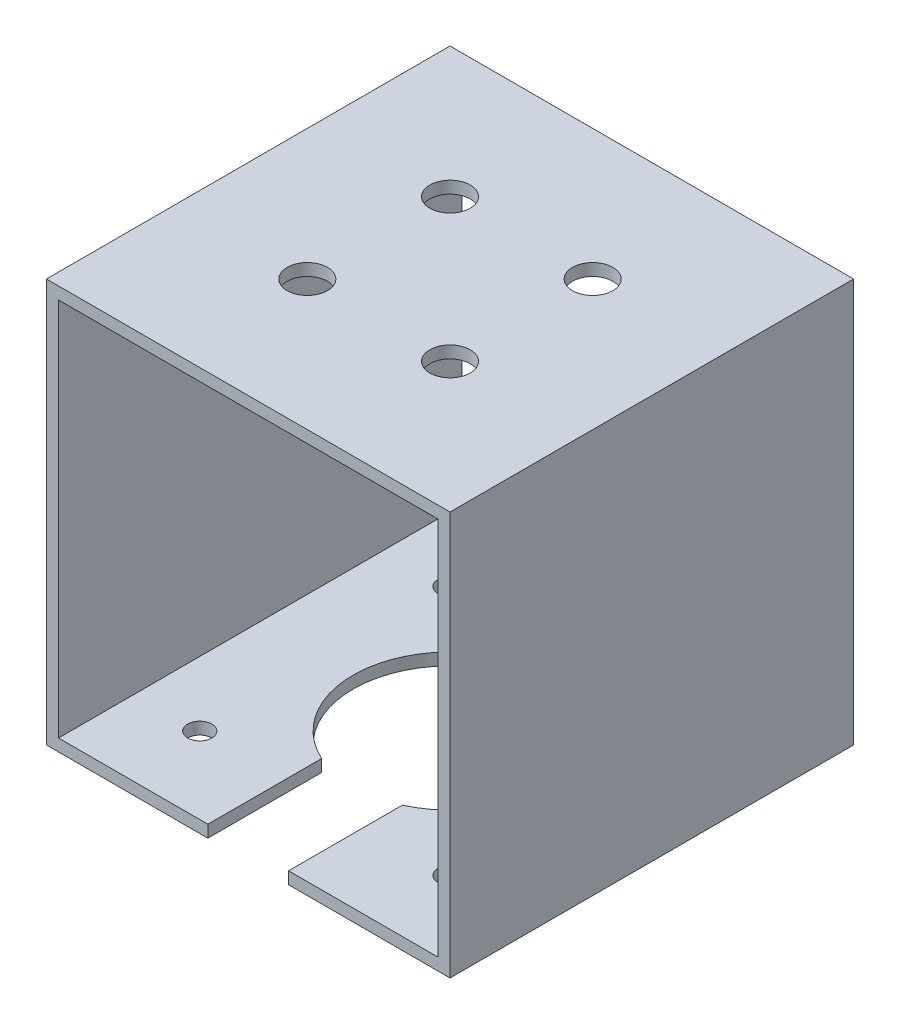
ISO-10303-21;
HEADER;
FILE_DESCRIPTION(('STEP AP214'),'2;1');
FILE_NAME('part.step','',(''),(''),'','','');
FILE_SCHEMA(('AUTOMOTIVE_DESIGN { 1 0 10303 214 1 1 1 1 }'));
ENDSEC;
DATA;
#1=APPLICATION_CONTEXT('core data for automotive mechanical design processes');
#2=APPLICATION_PROTOCOL_DEFINITION('international standard','automotive_design',2000,#1);
#3=PRODUCT_CONTEXT('',#1,'mechanical');
#4=PRODUCT('Part','Part','',(#3));
#5=PRODUCT_RELATED_PRODUCT_CATEGORY('part','',(#4));
#6=PRODUCT_DEFINITION_FORMATION('','',#4);
#7=PRODUCT_DEFINITION_CONTEXT('part definition',#1,'design');
#8=PRODUCT_DEFINITION('design','',#6,#7);
#9=PRODUCT_DEFINITION_SHAPE('','',#8);
#10=(LENGTH_UNIT() NAMED_UNIT(*) SI_UNIT(.MILLI.,.METRE.));
#11=(NAMED_UNIT(*) PLANE_ANGLE_UNIT() SI_UNIT($,.RADIAN.));
#12=(NAMED_UNIT(*) SI_UNIT($,.STERADIAN.) SOLID_ANGLE_UNIT());
#13=UNCERTAINTY_MEASURE_WITH_UNIT(LENGTH_MEASURE(1.E-05),#10,'distance_accuracy_value','');
#14=(GEOMETRIC_REPRESENTATION_CONTEXT(3) GLOBAL_UNCERTAINTY_ASSIGNED_CONTEXT((#13)) GLOBAL_UNIT_ASSIGNED_CONTEXT((#10,
#11,#12)) REPRESENTATION_CONTEXT('',''));
#15=CARTESIAN_POINT('',(0.,0.,0.));
#16=DIRECTION('',(0.,0.,1.));
#17=DIRECTION('',(1.,0.,0.));
#18=AXIS2_PLACEMENT_3D('',#15,#16,#17);
#19=CARTESIAN_POINT('',(25.,25.,50.));
#20=DIRECTION('',(0.,-1.,0.));
#21=DIRECTION('',(1.,0.,0.));
#22=AXIS2_PLACEMENT_3D('',#19,#20,#21);
#23=PLANE('',#22);
#24=CARTESIAN_POINT('',(-8.83883476483184,25.,33.8388347648319));
#25=DIRECTION('',(0.,1.,0.));
#26=DIRECTION('',(-1.,0.,0.));
#27=AXIS2_PLACEMENT_3D('',#24,#25,#26);
#28=CIRCLE('',#27,2.5);
#29=CARTESIAN_POINT('',(-11.3388347648318,25.,33.8388347648319));
#30=VERTEX_POINT('',#29);
#31=EDGE_CURVE('E160',#30,#30,#28,.T.);
#32=ORIENTED_EDGE('',*,*,#31,.F.);
#33=EDGE_LOOP('',(#32));
#34=FACE_BOUND('',#33,.T.);
#35=CARTESIAN_POINT('',(8.83883476483182,25.,33.8388347648319));
#36=DIRECTION('',(0.,1.,0.));
#37=DIRECTION('',(-1.,0.,0.));
#38=AXIS2_PLACEMENT_3D('',#35,#36,#37);
#39=CIRCLE('',#38,2.5);
#40=CARTESIAN_POINT('',(6.33883476483182,25.,33.8388347648319));
#41=VERTEX_POINT('',#40);
#42=EDGE_CURVE('E156',#41,#41,#39,.F.);
#43=ORIENTED_EDGE('',*,*,#42,.T.);
#44=EDGE_LOOP('',(#43));
#45=FACE_BOUND('',#44,.T.);
#46=CARTESIAN_POINT('',(-8.83883476483184,25.,16.1611652351681));
#47=DIRECTION('',(0.,1.,0.));
#48=DIRECTION('',(-1.,0.,0.));
#49=AXIS2_PLACEMENT_3D('',#46,#47,#48);
#50=CIRCLE('',#49,2.5);
#51=CARTESIAN_POINT('',(-11.3388347648318,25.,16.1611652351681));
#52=VERTEX_POINT('',#51);
#53=EDGE_CURVE('E169',#52,#52,#50,.F.);
#54=ORIENTED_EDGE('',*,*,#53,.T.);
#55=EDGE_LOOP('',(#54));
#56=FACE_BOUND('',#55,.T.);
#57=DIRECTION('',(-1.,0.,0.));
#58=VECTOR('',#57,1.);
#59=CARTESIAN_POINT('',(25.,25.,0.));
#60=LINE('',#59,#58);
#61=CARTESIAN_POINT('',(25.,25.,0.));
#62=VERTEX_POINT('',#61);
#63=CARTESIAN_POINT('',(-25.,25.,0.));
#64=VERTEX_POINT('',#63);
#65=EDGE_CURVE('E224',#62,#64,#60,.T.);
#66=ORIENTED_EDGE('',*,*,#65,.T.);
#67=DIRECTION('',(0.,0.,-1.));
#68=VECTOR('',#67,1.);
#69=CARTESIAN_POINT('',(-25.,25.,50.));
#70=LINE('',#69,#68);
#71=CARTESIAN_POINT('',(-25.,25.,50.));
#72=VERTEX_POINT('',#71);
#73=EDGE_CURVE('E230',#72,#64,#70,.T.);
#74=ORIENTED_EDGE('',*,*,#73,.F.);
#75=DIRECTION('',(-1.,0.,0.));
#76=VECTOR('',#75,1.);
#77=CARTESIAN_POINT('',(25.,25.,50.));
#78=LINE('',#77,#76);
#79=CARTESIAN_POINT('',(25.,25.,50.));
#80=VERTEX_POINT('',#79);
#81=EDGE_CURVE('E215',#80,#72,#78,.T.);
#82=ORIENTED_EDGE('',*,*,#81,.F.);
#83=DIRECTION('',(0.,0.,-1.));
#84=VECTOR('',#83,1.);
#85=CARTESIAN_POINT('',(25.,25.,50.));
#86=LINE('',#85,#84);
#87=EDGE_CURVE('E233',#80,#62,#86,.T.);
#88=ORIENTED_EDGE('',*,*,#87,.T.);
#89=EDGE_LOOP('',(#66,#74,#82,#88));
#90=FACE_BOUND('',#89,.T.);
#91=CARTESIAN_POINT('',(8.83883476483182,25.,16.1611652351681));
#92=DIRECTION('',(0.,1.,0.));
#93=DIRECTION('',(-1.,0.,0.));
#94=AXIS2_PLACEMENT_3D('',#91,#92,#93);
#95=CIRCLE('',#94,2.5);
#96=CARTESIAN_POINT('',(6.33883476483182,25.,16.1611652351681));
#97=VERTEX_POINT('',#96);
#98=EDGE_CURVE('E166',#97,#97,#95,.T.);
#99=ORIENTED_EDGE('',*,*,#98,.F.);
#100=EDGE_LOOP('',(#99));
#101=FACE_BOUND('',#100,.T.);
#102=ADVANCED_FACE('F55',(#34,#45,#56,#90,#101),#23,.F.);
#103=CARTESIAN_POINT('',(23.5,23.5,50.));
#104=DIRECTION('',(0.,-1.,0.));
#105=DIRECTION('',(1.,0.,0.));
#106=AXIS2_PLACEMENT_3D('',#103,#104,#105);
#107=PLANE('',#106);
#108=CARTESIAN_POINT('',(8.83883476483182,23.5,33.8388347648319));
#109=DIRECTION('',(0.,-1.,0.));
#110=DIRECTION('',(1.,0.,0.));
#111=AXIS2_PLACEMENT_3D('',#108,#109,#110);
#112=CIRCLE('',#111,2.5);
#113=CARTESIAN_POINT('',(11.3388347648318,23.5,33.8388347648319));
#114=VERTEX_POINT('',#113);
#115=EDGE_CURVE('E241',#114,#114,#112,.F.);
#116=ORIENTED_EDGE('',*,*,#115,.T.);
#117=EDGE_LOOP('',(#116));
#118=FACE_BOUND('',#117,.T.);
#119=CARTESIAN_POINT('',(-8.83883476483184,23.5,16.1611652351681));
#120=DIRECTION('',(0.,-1.,0.));
#121=DIRECTION('',(1.,0.,0.));
#122=AXIS2_PLACEMENT_3D('',#119,#120,#121);
#123=CIRCLE('',#122,2.5);
#124=CARTESIAN_POINT('',(-6.33883476483184,23.5,16.1611652351681));
#125=VERTEX_POINT('',#124);
#126=EDGE_CURVE('E174',#125,#125,#123,.F.);
#127=ORIENTED_EDGE('',*,*,#126,.T.);
#128=EDGE_LOOP('',(#127));
#129=FACE_BOUND('',#128,.T.);
#130=DIRECTION('',(-1.,0.,0.));
#131=VECTOR('',#130,1.);
#132=CARTESIAN_POINT('',(23.5,23.5,0.));
#133=LINE('',#132,#131);
#134=CARTESIAN_POINT('',(23.5,23.5,0.));
#135=VERTEX_POINT('',#134);
#136=CARTESIAN_POINT('',(-23.5,23.5,0.));
#137=VERTEX_POINT('',#136);
#138=EDGE_CURVE('E178',#135,#137,#133,.T.);
#139=ORIENTED_EDGE('',*,*,#138,.F.);
#140=DIRECTION('',(0.,0.,-1.));
#141=VECTOR('',#140,1.);
#142=CARTESIAN_POINT('',(23.5,23.5,50.));
#143=LINE('',#142,#141);
#144=CARTESIAN_POINT('',(23.5,23.5,50.));
#145=VERTEX_POINT('',#144);
#146=EDGE_CURVE('E202',#145,#135,#143,.T.);
#147=ORIENTED_EDGE('',*,*,#146,.F.);
#148=DIRECTION('',(-1.,0.,0.));
#149=VECTOR('',#148,1.);
#150=CARTESIAN_POINT('',(23.5,23.5,50.));
#151=LINE('',#150,#149);
#152=CARTESIAN_POINT('',(-23.5,23.5,50.));
#153=VERTEX_POINT('',#152);
#154=EDGE_CURVE('E185',#145,#153,#151,.T.);
#155=ORIENTED_EDGE('',*,*,#154,.T.);
#156=DIRECTION('',(0.,0.,-1.));
#157=VECTOR('',#156,1.);
#158=CARTESIAN_POINT('',(-23.5,23.5,50.));
#159=LINE('',#158,#157);
#160=EDGE_CURVE('E187',#153,#137,#159,.T.);
#161=ORIENTED_EDGE('',*,*,#160,.T.);
#162=EDGE_LOOP('',(#139,#147,#155,#161));
#163=FACE_BOUND('',#162,.T.);
#164=CARTESIAN_POINT('',(-8.83883476483184,23.5,33.8388347648319));
#165=DIRECTION('',(0.,-1.,0.));
#166=DIRECTION('',(1.,0.,0.));
#167=AXIS2_PLACEMENT_3D('',#164,#165,#166);
#168=CIRCLE('',#167,2.5);
#169=CARTESIAN_POINT('',(-6.33883476483184,23.5,33.8388347648319));
#170=VERTEX_POINT('',#169);
#171=EDGE_CURVE('E244',#170,#170,#168,.T.);
#172=ORIENTED_EDGE('',*,*,#171,.F.);
#173=EDGE_LOOP('',(#172));
#174=FACE_BOUND('',#173,.T.);
#175=CARTESIAN_POINT('',(8.83883476483182,23.5,16.1611652351681));
#176=DIRECTION('',(0.,-1.,0.));
#177=DIRECTION('',(1.,0.,0.));
#178=AXIS2_PLACEMENT_3D('',#175,#176,#177);
#179=CIRCLE('',#178,2.5);
#180=CARTESIAN_POINT('',(11.3388347648318,23.5,16.1611652351681));
#181=VERTEX_POINT('',#180);
#182=EDGE_CURVE('E192',#181,#181,#179,.T.);
#183=ORIENTED_EDGE('',*,*,#182,.F.);
#184=EDGE_LOOP('',(#183));
#185=FACE_BOUND('',#184,.T.);
#186=ADVANCED_FACE('F320',(#118,#129,#163,#174,#185),#107,.T.);
#187=CARTESIAN_POINT('',(0.,0.,50.));
#188=DIRECTION('',(0.,0.,-1.));
#189=DIRECTION('',(-1.,0.,0.));
#190=AXIS2_PLACEMENT_3D('',#187,#188,#189);
#191=PLANE('',#190);
#192=DIRECTION('',(1.,0.,0.));
#193=VECTOR('',#192,1.);
#194=CARTESIAN_POINT('',(23.5,-23.5,50.));
#195=LINE('',#194,#193);
#196=CARTESIAN_POINT('',(5.,-23.5,50.));
#197=VERTEX_POINT('',#196);
#198=CARTESIAN_POINT('',(23.5,-23.5,50.));
#199=VERTEX_POINT('',#198);
#200=EDGE_CURVE('E177',#197,#199,#195,.T.);
#201=ORIENTED_EDGE('',*,*,#200,.F.);
#202=DIRECTION('',(0.,-1.,0.));
#203=VECTOR('',#202,1.);
#204=CARTESIAN_POINT('',(5.,0.,50.));
#205=LINE('',#204,#203);
#206=CARTESIAN_POINT('',(5.,-25.,50.));
#207=VERTEX_POINT('',#206);
#208=EDGE_CURVE('E296',#197,#207,#205,.T.);
#209=ORIENTED_EDGE('',*,*,#208,.T.);
#210=DIRECTION('',(1.,0.,0.));
#211=VECTOR('',#210,1.);
#212=CARTESIAN_POINT('',(25.,-25.,50.));
#213=LINE('',#212,#211);
#214=CARTESIAN_POINT('',(25.,-25.,50.));
#215=VERTEX_POINT('',#214);
#216=EDGE_CURVE('E153',#207,#215,#213,.T.);
#217=ORIENTED_EDGE('',*,*,#216,.T.);
#218=DIRECTION('',(0.,1.,0.));
#219=VECTOR('',#218,1.);
#220=CARTESIAN_POINT('',(25.,-25.,50.));
#221=LINE('',#220,#219);
#222=EDGE_CURVE('E213',#215,#80,#221,.T.);
#223=ORIENTED_EDGE('',*,*,#222,.T.);
#224=ORIENTED_EDGE('',*,*,#81,.T.);
#225=DIRECTION('',(0.,-1.,0.));
#226=VECTOR('',#225,1.);
#227=CARTESIAN_POINT('',(-25.,-25.,50.));
#228=LINE('',#227,#226);
#229=CARTESIAN_POINT('',(-25.,-25.,50.));
#230=VERTEX_POINT('',#229);
#231=EDGE_CURVE('E217',#72,#230,#228,.T.);
#232=ORIENTED_EDGE('',*,*,#231,.T.);
#233=CARTESIAN_POINT('',(-5.,-25.,50.));
#234=VERTEX_POINT('',#233);
#235=EDGE_CURVE('E210',#230,#234,#213,.T.);
#236=ORIENTED_EDGE('',*,*,#235,.T.);
#237=DIRECTION('',(0.,1.,0.));
#238=VECTOR('',#237,1.);
#239=CARTESIAN_POINT('',(-5.,0.,50.));
#240=LINE('',#239,#238);
#241=CARTESIAN_POINT('',(-5.,-23.5,50.));
#242=VERTEX_POINT('',#241);
#243=EDGE_CURVE('E299',#234,#242,#240,.T.);
#244=ORIENTED_EDGE('',*,*,#243,.T.);
#245=CARTESIAN_POINT('',(-23.5,-23.5,50.));
#246=VERTEX_POINT('',#245);
#247=EDGE_CURVE('E179',#246,#242,#195,.T.);
#248=ORIENTED_EDGE('',*,*,#247,.F.);
#249=DIRECTION('',(0.,-1.,0.));
#250=VECTOR('',#249,1.);
#251=CARTESIAN_POINT('',(-23.5,-23.5,50.));
#252=LINE('',#251,#250);
#253=EDGE_CURVE('E175',#153,#246,#252,.T.);
#254=ORIENTED_EDGE('',*,*,#253,.F.);
#255=ORIENTED_EDGE('',*,*,#154,.F.);
#256=DIRECTION('',(0.,1.,0.));
#257=VECTOR('',#256,1.);
#258=CARTESIAN_POINT('',(23.5,-23.5,50.));
#259=LINE('',#258,#257);
#260=EDGE_CURVE('E182',#199,#145,#259,.T.);
#261=ORIENTED_EDGE('',*,*,#260,.F.);
#262=EDGE_LOOP('',(#201,#209,#217,#223,#224,#232,#236,#244,#248,#254,#255,#261));
#263=FACE_BOUND('',#262,.T.);
#264=ADVANCED_FACE('F309',(#263),#191,.F.);
#265=CARTESIAN_POINT('',(0.,0.,0.));
#266=DIRECTION('',(0.,0.,-1.));
#267=DIRECTION('',(-1.,0.,0.));
#268=AXIS2_PLACEMENT_3D('',#265,#266,#267);
#269=PLANE('',#268);
#270=DIRECTION('',(1.,0.,0.));
#271=VECTOR('',#270,1.);
#272=CARTESIAN_POINT('',(25.,-25.,0.));
#273=LINE('',#272,#271);
#274=CARTESIAN_POINT('',(-25.,-25.,0.));
#275=VERTEX_POINT('',#274);
#276=CARTESIAN_POINT('',(25.,-25.,0.));
#277=VERTEX_POINT('',#276);
#278=EDGE_CURVE('E209',#275,#277,#273,.T.);
#279=ORIENTED_EDGE('',*,*,#278,.F.);
#280=DIRECTION('',(0.,-1.,0.));
#281=VECTOR('',#280,1.);
#282=CARTESIAN_POINT('',(-25.,-25.,0.));
#283=LINE('',#282,#281);
#284=EDGE_CURVE('E226',#64,#275,#283,.T.);
#285=ORIENTED_EDGE('',*,*,#284,.F.);
#286=ORIENTED_EDGE('',*,*,#65,.F.);
#287=DIRECTION('',(0.,1.,0.));
#288=VECTOR('',#287,1.);
#289=CARTESIAN_POINT('',(25.,-25.,0.));
#290=LINE('',#289,#288);
#291=EDGE_CURVE('E222',#277,#62,#290,.T.);
#292=ORIENTED_EDGE('',*,*,#291,.F.);
#293=EDGE_LOOP('',(#279,#285,#286,#292));
#294=FACE_BOUND('',#293,.T.);
#295=ORIENTED_EDGE('',*,*,#138,.T.);
#296=DIRECTION('',(0.,-1.,0.));
#297=VECTOR('',#296,1.);
#298=CARTESIAN_POINT('',(-23.5,-23.5,0.));
#299=LINE('',#298,#297);
#300=CARTESIAN_POINT('',(-23.5,-23.5,0.));
#301=VERTEX_POINT('',#300);
#302=EDGE_CURVE('E188',#137,#301,#299,.T.);
#303=ORIENTED_EDGE('',*,*,#302,.T.);
#304=DIRECTION('',(1.,0.,0.));
#305=VECTOR('',#304,1.);
#306=CARTESIAN_POINT('',(23.5,-23.5,0.));
#307=LINE('',#306,#305);
#308=CARTESIAN_POINT('',(23.5,-23.5,0.));
#309=VERTEX_POINT('',#308);
#310=EDGE_CURVE('E191',#301,#309,#307,.T.);
#311=ORIENTED_EDGE('',*,*,#310,.T.);
#312=DIRECTION('',(0.,1.,0.));
#313=VECTOR('',#312,1.);
#314=CARTESIAN_POINT('',(23.5,-23.5,0.));
#315=LINE('',#314,#313);
#316=EDGE_CURVE('E195',#309,#135,#315,.T.);
#317=ORIENTED_EDGE('',*,*,#316,.T.);
#318=EDGE_LOOP('',(#295,#303,#311,#317));
#319=FACE_BOUND('',#318,.T.);
#320=ADVANCED_FACE('F316',(#294,#319),#269,.T.);
#321=CARTESIAN_POINT('',(25.,-25.,50.));
#322=DIRECTION('',(0.,1.,0.));
#323=DIRECTION('',(-1.,0.,0.));
#324=AXIS2_PLACEMENT_3D('',#321,#322,#323);
#325=PLANE('',#324);
#326=CARTESIAN_POINT('',(15.5000000000003,-25.,9.49999999999633));
#327=DIRECTION('',(0.,-1.,0.));
#328=DIRECTION('',(1.,0.,0.));
#329=AXIS2_PLACEMENT_3D('',#326,#327,#328);
#330=CIRCLE('',#329,1.50000000000047);
#331=CARTESIAN_POINT('',(17.0000000000007,-25.,9.49999999999633));
#332=VERTEX_POINT('',#331);
#333=EDGE_CURVE('E286',#332,#332,#330,.T.);
#334=ORIENTED_EDGE('',*,*,#333,.F.);
#335=EDGE_LOOP('',(#334));
#336=FACE_BOUND('',#335,.T.);
#337=CARTESIAN_POINT('',(-15.5000000000008,-25.,40.4999999999953));
#338=DIRECTION('',(0.,-1.,0.));
#339=DIRECTION('',(1.,0.,0.));
#340=AXIS2_PLACEMENT_3D('',#337,#338,#339);
#341=CIRCLE('',#340,1.5000000000009);
#342=CARTESIAN_POINT('',(-13.9999999999999,-25.,40.4999999999953));
#343=VERTEX_POINT('',#342);
#344=EDGE_CURVE('E288',#343,#343,#341,.T.);
#345=ORIENTED_EDGE('',*,*,#344,.F.);
#346=EDGE_LOOP('',(#345));
#347=FACE_BOUND('',#346,.T.);
#348=CARTESIAN_POINT('',(-15.4999999999997,-25.,9.49999999999527));
#349=DIRECTION('',(0.,-1.,0.));
#350=DIRECTION('',(1.,0.,0.));
#351=AXIS2_PLACEMENT_3D('',#348,#349,#350);
#352=CIRCLE('',#351,1.5);
#353=CARTESIAN_POINT('',(-13.9999999999997,-25.,9.49999999999527));
#354=VERTEX_POINT('',#353);
#355=EDGE_CURVE('E292',#354,#354,#352,.T.);
#356=ORIENTED_EDGE('',*,*,#355,.F.);
#357=EDGE_LOOP('',(#356));
#358=FACE_BOUND('',#357,.T.);
#359=CARTESIAN_POINT('',(15.4999999999992,-25.,40.4999999999963));
#360=DIRECTION('',(0.,-1.,0.));
#361=DIRECTION('',(1.,0.,0.));
#362=AXIS2_PLACEMENT_3D('',#359,#360,#361);
#363=CIRCLE('',#362,1.50000000000124);
#364=CARTESIAN_POINT('',(17.0000000000004,-25.,40.4999999999963));
#365=VERTEX_POINT('',#364);
#366=EDGE_CURVE('E253',#365,#365,#363,.T.);
#367=ORIENTED_EDGE('',*,*,#366,.F.);
#368=EDGE_LOOP('',(#367));
#369=FACE_BOUND('',#368,.T.);
#370=ORIENTED_EDGE('',*,*,#216,.F.);
#371=DIRECTION('',(0.,0.,1.));
#372=VECTOR('',#371,1.);
#373=CARTESIAN_POINT('',(5.,-25.,68.4151289486586));
#374=LINE('',#373,#372);
#375=CARTESIAN_POINT('',(5.,-25.,35.9087121146357));
#376=VERTEX_POINT('',#375);
#377=EDGE_CURVE('E142',#376,#207,#374,.T.);
#378=ORIENTED_EDGE('',*,*,#377,.F.);
#379=CARTESIAN_POINT('',(0.,-25.,25.));
#380=DIRECTION('',(0.,1.,0.));
#381=DIRECTION('',(-1.,0.,0.));
#382=AXIS2_PLACEMENT_3D('',#379,#380,#381);
#383=CIRCLE('',#382,12.);
#384=CARTESIAN_POINT('',(-5.,-25.,35.9087121146357));
#385=VERTEX_POINT('',#384);
#386=EDGE_CURVE('E151',#376,#385,#383,.T.);
#387=ORIENTED_EDGE('',*,*,#386,.T.);
#388=DIRECTION('',(0.,0.,-1.));
#389=VECTOR('',#388,1.);
#390=CARTESIAN_POINT('',(-5.,-25.,68.4151289486586));
#391=LINE('',#390,#389);
#392=EDGE_CURVE('E70',#234,#385,#391,.T.);
#393=ORIENTED_EDGE('',*,*,#392,.F.);
#394=ORIENTED_EDGE('',*,*,#235,.F.);
#395=DIRECTION('',(0.,0.,-1.));
#396=VECTOR('',#395,1.);
#397=CARTESIAN_POINT('',(-25.,-25.,50.));
#398=LINE('',#397,#396);
#399=EDGE_CURVE('E219',#230,#275,#398,.T.);
#400=ORIENTED_EDGE('',*,*,#399,.T.);
#401=ORIENTED_EDGE('',*,*,#278,.T.);
#402=DIRECTION('',(0.,0.,-1.));
#403=VECTOR('',#402,1.);
#404=CARTESIAN_POINT('',(25.,-25.,50.));
#405=LINE('',#404,#403);
#406=EDGE_CURVE('E236',#215,#277,#405,.T.);
#407=ORIENTED_EDGE('',*,*,#406,.F.);
#408=EDGE_LOOP('',(#370,#378,#387,#393,#394,#400,#401,#407));
#409=FACE_BOUND('',#408,.T.);
#410=ADVANCED_FACE('F57',(#336,#347,#358,#369,#409),#325,.F.);
#411=CARTESIAN_POINT('',(25.,-25.,50.));
#412=DIRECTION('',(-1.,0.,0.));
#413=DIRECTION('',(0.,0.,1.));
#414=AXIS2_PLACEMENT_3D('',#411,#412,#413);
#415=PLANE('',#414);
#416=ORIENTED_EDGE('',*,*,#291,.T.);
#417=ORIENTED_EDGE('',*,*,#87,.F.);
#418=ORIENTED_EDGE('',*,*,#222,.F.);
#419=ORIENTED_EDGE('',*,*,#406,.T.);
#420=EDGE_LOOP('',(#416,#417,#418,#419));
#421=FACE_BOUND('',#420,.T.);
#422=ADVANCED_FACE('F348',(#421),#415,.F.);
#423=CARTESIAN_POINT('',(-25.,-25.,50.));
#424=DIRECTION('',(1.,0.,0.));
#425=DIRECTION('',(0.,0.,-1.));
#426=AXIS2_PLACEMENT_3D('',#423,#424,#425);
#427=PLANE('',#426);
#428=ORIENTED_EDGE('',*,*,#284,.T.);
#429=ORIENTED_EDGE('',*,*,#399,.F.);
#430=ORIENTED_EDGE('',*,*,#231,.F.);
#431=ORIENTED_EDGE('',*,*,#73,.T.);
#432=EDGE_LOOP('',(#428,#429,#430,#431));
#433=FACE_BOUND('',#432,.T.);
#434=ADVANCED_FACE('F346',(#433),#427,.F.);
#435=CARTESIAN_POINT('',(-23.5,-23.5,50.));
#436=DIRECTION('',(1.,0.,0.));
#437=DIRECTION('',(0.,0.,-1.));
#438=AXIS2_PLACEMENT_3D('',#435,#436,#437);
#439=PLANE('',#438);
#440=ORIENTED_EDGE('',*,*,#302,.F.);
#441=ORIENTED_EDGE('',*,*,#160,.F.);
#442=ORIENTED_EDGE('',*,*,#253,.T.);
#443=DIRECTION('',(0.,0.,-1.));
#444=VECTOR('',#443,1.);
#445=CARTESIAN_POINT('',(-23.5,-23.5,50.));
#446=LINE('',#445,#444);
#447=EDGE_CURVE('E206',#246,#301,#446,.T.);
#448=ORIENTED_EDGE('',*,*,#447,.T.);
#449=EDGE_LOOP('',(#440,#441,#442,#448));
#450=FACE_BOUND('',#449,.T.);
#451=ADVANCED_FACE('F269',(#450),#439,.T.);
#452=CARTESIAN_POINT('',(23.5,-23.5,50.));
#453=DIRECTION('',(0.,1.,0.));
#454=DIRECTION('',(-1.,0.,0.));
#455=AXIS2_PLACEMENT_3D('',#452,#453,#454);
#456=PLANE('',#455);
#457=DIRECTION('',(0.,0.,-1.));
#458=VECTOR('',#457,1.);
#459=CARTESIAN_POINT('',(5.,-23.5,50.));
#460=LINE('',#459,#458);
#461=CARTESIAN_POINT('',(5.,-23.5,35.9087121146357));
#462=VERTEX_POINT('',#461);
#463=EDGE_CURVE('E78',#197,#462,#460,.T.);
#464=ORIENTED_EDGE('',*,*,#463,.F.);
#465=ORIENTED_EDGE('',*,*,#200,.T.);
#466=DIRECTION('',(0.,0.,-1.));
#467=VECTOR('',#466,1.);
#468=CARTESIAN_POINT('',(23.5,-23.5,50.));
#469=LINE('',#468,#467);
#470=EDGE_CURVE('E204',#199,#309,#469,.T.);
#471=ORIENTED_EDGE('',*,*,#470,.T.);
#472=ORIENTED_EDGE('',*,*,#310,.F.);
#473=ORIENTED_EDGE('',*,*,#447,.F.);
#474=ORIENTED_EDGE('',*,*,#247,.T.);
#475=DIRECTION('',(0.,0.,1.));
#476=VECTOR('',#475,1.);
#477=CARTESIAN_POINT('',(-5.,-23.5,50.));
#478=LINE('',#477,#476);
#479=CARTESIAN_POINT('',(-5.,-23.5,35.9087121146357));
#480=VERTEX_POINT('',#479);
#481=EDGE_CURVE('E302',#480,#242,#478,.T.);
#482=ORIENTED_EDGE('',*,*,#481,.F.);
#483=CARTESIAN_POINT('',(0.,-23.5,25.));
#484=DIRECTION('',(0.,1.,0.));
#485=DIRECTION('',(-1.,0.,0.));
#486=AXIS2_PLACEMENT_3D('',#483,#484,#485);
#487=CIRCLE('',#486,12.);
#488=EDGE_CURVE('E157',#462,#480,#487,.T.);
#489=ORIENTED_EDGE('',*,*,#488,.F.);
#490=EDGE_LOOP('',(#464,#465,#471,#472,#473,#474,#482,#489));
#491=FACE_BOUND('',#490,.T.);
#492=CARTESIAN_POINT('',(15.5000000000003,-23.5,9.49999999999633));
#493=DIRECTION('',(0.,1.,0.));
#494=DIRECTION('',(-1.,0.,0.));
#495=AXIS2_PLACEMENT_3D('',#492,#493,#494);
#496=CIRCLE('',#495,1.50000000000047);
#497=CARTESIAN_POINT('',(13.9999999999998,-23.5,9.49999999999633));
#498=VERTEX_POINT('',#497);
#499=EDGE_CURVE('E162',#498,#498,#496,.T.);
#500=ORIENTED_EDGE('',*,*,#499,.F.);
#501=EDGE_LOOP('',(#500));
#502=FACE_BOUND('',#501,.T.);
#503=CARTESIAN_POINT('',(-15.5000000000008,-23.5,40.4999999999953));
#504=DIRECTION('',(0.,1.,0.));
#505=DIRECTION('',(-1.,0.,0.));
#506=AXIS2_PLACEMENT_3D('',#503,#504,#505);
#507=CIRCLE('',#506,1.5000000000009);
#508=CARTESIAN_POINT('',(-17.0000000000017,-23.5,40.4999999999953));
#509=VERTEX_POINT('',#508);
#510=EDGE_CURVE('E256',#509,#509,#507,.T.);
#511=ORIENTED_EDGE('',*,*,#510,.F.);
#512=EDGE_LOOP('',(#511));
#513=FACE_BOUND('',#512,.T.);
#514=CARTESIAN_POINT('',(-15.4999999999997,-23.5,9.49999999999527));
#515=DIRECTION('',(0.,1.,0.));
#516=DIRECTION('',(-1.,0.,0.));
#517=AXIS2_PLACEMENT_3D('',#514,#515,#516);
#518=CIRCLE('',#517,1.5);
#519=CARTESIAN_POINT('',(-16.9999999999998,-23.5,9.49999999999527));
#520=VERTEX_POINT('',#519);
#521=EDGE_CURVE('E252',#520,#520,#518,.T.);
#522=ORIENTED_EDGE('',*,*,#521,.F.);
#523=EDGE_LOOP('',(#522));
#524=FACE_BOUND('',#523,.T.);
#525=CARTESIAN_POINT('',(15.4999999999992,-23.5,40.4999999999963));
#526=DIRECTION('',(0.,1.,0.));
#527=DIRECTION('',(-1.,0.,0.));
#528=AXIS2_PLACEMENT_3D('',#525,#526,#527);
#529=CIRCLE('',#528,1.50000000000124);
#530=CARTESIAN_POINT('',(13.999999999998,-23.5,40.4999999999963));
#531=VERTEX_POINT('',#530);
#532=EDGE_CURVE('E249',#531,#531,#529,.T.);
#533=ORIENTED_EDGE('',*,*,#532,.F.);
#534=EDGE_LOOP('',(#533));
#535=FACE_BOUND('',#534,.T.);
#536=ADVANCED_FACE('F265',(#491,#502,#513,#524,#535),#456,.T.);
#537=CARTESIAN_POINT('',(23.5,-23.5,50.));
#538=DIRECTION('',(-1.,0.,0.));
#539=DIRECTION('',(0.,0.,1.));
#540=AXIS2_PLACEMENT_3D('',#537,#538,#539);
#541=PLANE('',#540);
#542=ORIENTED_EDGE('',*,*,#316,.F.);
#543=ORIENTED_EDGE('',*,*,#470,.F.);
#544=ORIENTED_EDGE('',*,*,#260,.T.);
#545=ORIENTED_EDGE('',*,*,#146,.T.);
#546=EDGE_LOOP('',(#542,#543,#544,#545));
#547=FACE_BOUND('',#546,.T.);
#548=ADVANCED_FACE('F268',(#547),#541,.T.);
#549=CARTESIAN_POINT('',(-8.83883476483184,15.,16.1611652351681));
#550=DIRECTION('',(0.,1.,0.));
#551=DIRECTION('',(-1.,0.,0.));
#552=AXIS2_PLACEMENT_3D('',#549,#550,#551);
#553=CYLINDRICAL_SURFACE('',#552,2.5);
#554=ORIENTED_EDGE('',*,*,#126,.F.);
#555=EDGE_LOOP('',(#554));
#556=FACE_BOUND('',#555,.T.);
#557=ORIENTED_EDGE('',*,*,#53,.F.);
#558=EDGE_LOOP('',(#557));
#559=FACE_BOUND('',#558,.T.);
#560=ADVANCED_FACE('F327',(#556,#559),#553,.F.);
#561=CARTESIAN_POINT('',(8.83883476483182,15.,33.8388347648319));
#562=DIRECTION('',(0.,1.,0.));
#563=DIRECTION('',(-1.,0.,0.));
#564=AXIS2_PLACEMENT_3D('',#561,#562,#563);
#565=CYLINDRICAL_SURFACE('',#564,2.5);
#566=ORIENTED_EDGE('',*,*,#115,.F.);
#567=EDGE_LOOP('',(#566));
#568=FACE_BOUND('',#567,.T.);
#569=ORIENTED_EDGE('',*,*,#42,.F.);
#570=EDGE_LOOP('',(#569));
#571=FACE_BOUND('',#570,.T.);
#572=ADVANCED_FACE('F332',(#568,#571),#565,.F.);
#573=CARTESIAN_POINT('',(-8.83883476483184,15.,33.8388347648319));
#574=DIRECTION('',(0.,1.,0.));
#575=DIRECTION('',(-1.,0.,0.));
#576=AXIS2_PLACEMENT_3D('',#573,#574,#575);
#577=CYLINDRICAL_SURFACE('',#576,2.5);
#578=ORIENTED_EDGE('',*,*,#171,.T.);
#579=EDGE_LOOP('',(#578));
#580=FACE_BOUND('',#579,.T.);
#581=ORIENTED_EDGE('',*,*,#31,.T.);
#582=EDGE_LOOP('',(#581));
#583=FACE_BOUND('',#582,.T.);
#584=ADVANCED_FACE('F434',(#580,#583),#577,.F.);
#585=CARTESIAN_POINT('',(8.83883476483182,15.,16.1611652351681));
#586=DIRECTION('',(0.,1.,0.));
#587=DIRECTION('',(-1.,0.,0.));
#588=AXIS2_PLACEMENT_3D('',#585,#586,#587);
#589=CYLINDRICAL_SURFACE('',#588,2.5);
#590=ORIENTED_EDGE('',*,*,#182,.T.);
#591=EDGE_LOOP('',(#590));
#592=FACE_BOUND('',#591,.T.);
#593=ORIENTED_EDGE('',*,*,#98,.T.);
#594=EDGE_LOOP('',(#593));
#595=FACE_BOUND('',#594,.T.);
#596=ADVANCED_FACE('F398',(#592,#595),#589,.F.);
#597=CARTESIAN_POINT('',(0.,-33.5,25.));
#598=DIRECTION('',(0.,1.,0.));
#599=DIRECTION('',(-1.,0.,0.));
#600=AXIS2_PLACEMENT_3D('',#597,#598,#599);
#601=CYLINDRICAL_SURFACE('',#600,12.);
#602=ORIENTED_EDGE('',*,*,#386,.F.);
#603=DIRECTION('',(0.,1.,0.));
#604=VECTOR('',#603,1.);
#605=CARTESIAN_POINT('',(5.,-33.5,35.9087121146357));
#606=LINE('',#605,#604);
#607=EDGE_CURVE('E13',#376,#462,#606,.T.);
#608=ORIENTED_EDGE('',*,*,#607,.T.);
#609=ORIENTED_EDGE('',*,*,#488,.T.);
#610=DIRECTION('',(0.,1.,0.));
#611=VECTOR('',#610,1.);
#612=CARTESIAN_POINT('',(-5.,-33.5,35.9087121146357));
#613=LINE('',#612,#611);
#614=EDGE_CURVE('E63',#480,#385,#613,.F.);
#615=ORIENTED_EDGE('',*,*,#614,.T.);
#616=EDGE_LOOP('',(#602,#608,#609,#615));
#617=FACE_BOUND('',#616,.T.);
#618=ADVANCED_FACE('F155',(#617),#601,.F.);
#619=CARTESIAN_POINT('',(15.4999999999992,-15.,40.4999999999963));
#620=DIRECTION('',(0.,-1.,0.));
#621=DIRECTION('',(1.,0.,0.));
#622=AXIS2_PLACEMENT_3D('',#619,#620,#621);
#623=CYLINDRICAL_SURFACE('',#622,1.50000000000124);
#624=ORIENTED_EDGE('',*,*,#532,.T.);
#625=EDGE_LOOP('',(#624));
#626=FACE_BOUND('',#625,.T.);
#627=ORIENTED_EDGE('',*,*,#366,.T.);
#628=EDGE_LOOP('',(#627));
#629=FACE_BOUND('',#628,.T.);
#630=ADVANCED_FACE('F278',(#626,#629),#623,.F.);
#631=CARTESIAN_POINT('',(-15.4999999999997,-15.,9.49999999999527));
#632=DIRECTION('',(0.,-1.,0.));
#633=DIRECTION('',(1.,0.,0.));
#634=AXIS2_PLACEMENT_3D('',#631,#632,#633);
#635=CYLINDRICAL_SURFACE('',#634,1.5);
#636=ORIENTED_EDGE('',*,*,#521,.T.);
#637=EDGE_LOOP('',(#636));
#638=FACE_BOUND('',#637,.T.);
#639=ORIENTED_EDGE('',*,*,#355,.T.);
#640=EDGE_LOOP('',(#639));
#641=FACE_BOUND('',#640,.T.);
#642=ADVANCED_FACE('F281',(#638,#641),#635,.F.);
#643=CARTESIAN_POINT('',(-15.5000000000008,-15.,40.4999999999953));
#644=DIRECTION('',(0.,-1.,0.));
#645=DIRECTION('',(1.,0.,0.));
#646=AXIS2_PLACEMENT_3D('',#643,#644,#645);
#647=CYLINDRICAL_SURFACE('',#646,1.5000000000009);
#648=ORIENTED_EDGE('',*,*,#510,.T.);
#649=EDGE_LOOP('',(#648));
#650=FACE_BOUND('',#649,.T.);
#651=ORIENTED_EDGE('',*,*,#344,.T.);
#652=EDGE_LOOP('',(#651));
#653=FACE_BOUND('',#652,.T.);
#654=ADVANCED_FACE('F426',(#650,#653),#647,.F.);
#655=CARTESIAN_POINT('',(15.5000000000003,-15.,9.49999999999633));
#656=DIRECTION('',(0.,-1.,0.));
#657=DIRECTION('',(1.,0.,0.));
#658=AXIS2_PLACEMENT_3D('',#655,#656,#657);
#659=CYLINDRICAL_SURFACE('',#658,1.50000000000047);
#660=ORIENTED_EDGE('',*,*,#499,.T.);
#661=EDGE_LOOP('',(#660));
#662=FACE_BOUND('',#661,.T.);
#663=ORIENTED_EDGE('',*,*,#333,.T.);
#664=EDGE_LOOP('',(#663));
#665=FACE_BOUND('',#664,.T.);
#666=ADVANCED_FACE('F262',(#662,#665),#659,.F.);
#667=CARTESIAN_POINT('',(-5.,-15.,68.4151289486586));
#668=DIRECTION('',(-1.,0.,0.));
#669=DIRECTION('',(0.,-1.,0.));
#670=AXIS2_PLACEMENT_3D('',#667,#668,#669);
#671=PLANE('',#670);
#672=ORIENTED_EDGE('',*,*,#392,.T.);
#673=ORIENTED_EDGE('',*,*,#614,.F.);
#674=ORIENTED_EDGE('',*,*,#481,.T.);
#675=ORIENTED_EDGE('',*,*,#243,.F.);
#676=EDGE_LOOP('',(#672,#673,#674,#675));
#677=FACE_BOUND('',#676,.T.);
#678=ADVANCED_FACE('F305',(#677),#671,.F.);
#679=CARTESIAN_POINT('',(5.,-15.,68.4151289486586));
#680=DIRECTION('',(1.,0.,0.));
#681=DIRECTION('',(0.,1.,0.));
#682=AXIS2_PLACEMENT_3D('',#679,#680,#681);
#683=PLANE('',#682);
#684=ORIENTED_EDGE('',*,*,#463,.T.);
#685=ORIENTED_EDGE('',*,*,#607,.F.);
#686=ORIENTED_EDGE('',*,*,#377,.T.);
#687=ORIENTED_EDGE('',*,*,#208,.F.);
#688=EDGE_LOOP('',(#684,#685,#686,#687));
#689=FACE_BOUND('',#688,.T.);
#690=ADVANCED_FACE('F141',(#689),#683,.F.);
#691=CLOSED_SHELL('',(#102,#186,#264,#320,#410,#422,#434,#451,#536,#548,#560,#572,#584,#596,
#618,#630,#642,#654,#666,#678,#690));
#692=MANIFOLD_SOLID_BREP('B2',#691);
#693=ADVANCED_BREP_SHAPE_REPRESENTATION('',(#18,#692),#14);
#694=SHAPE_DEFINITION_REPRESENTATION(#9,#693);
ENDSEC;
END-ISO-10303-21;
